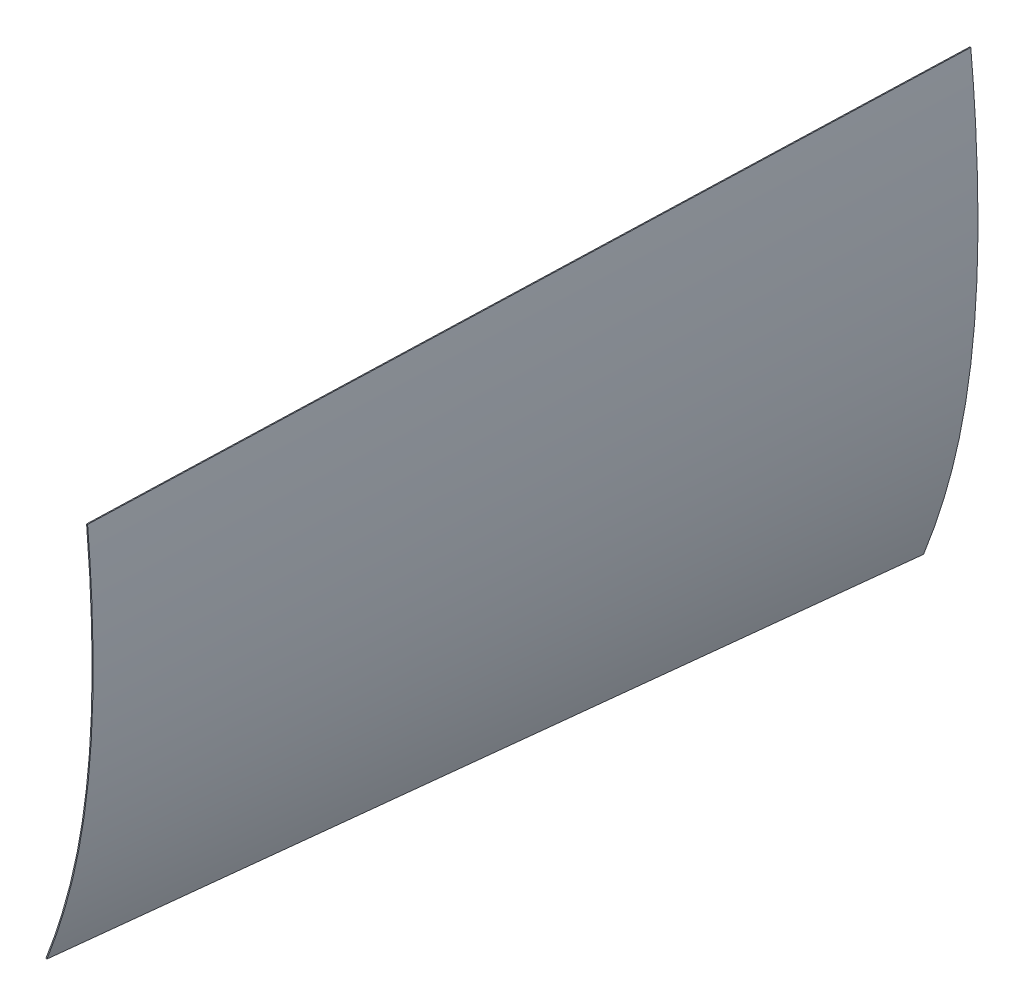
ISO-10303-21;
HEADER;
FILE_DESCRIPTION(('STEP AP214'),'2;1');
FILE_NAME('part.step','',(''),(''),'','','');
FILE_SCHEMA(('AUTOMOTIVE_DESIGN { 1 0 10303 214 1 1 1 1 }'));
ENDSEC;
DATA;
#1=APPLICATION_CONTEXT('core data for automotive mechanical design processes');
#2=APPLICATION_PROTOCOL_DEFINITION('international standard','automotive_design',2000,#1);
#3=PRODUCT_CONTEXT('',#1,'mechanical');
#4=PRODUCT('Part','Part','',(#3));
#5=PRODUCT_RELATED_PRODUCT_CATEGORY('part','',(#4));
#6=PRODUCT_DEFINITION_FORMATION('','',#4);
#7=PRODUCT_DEFINITION_CONTEXT('part definition',#1,'design');
#8=PRODUCT_DEFINITION('design','',#6,#7);
#9=PRODUCT_DEFINITION_SHAPE('','',#8);
#10=(LENGTH_UNIT() NAMED_UNIT(*) SI_UNIT(.MILLI.,.METRE.));
#11=(NAMED_UNIT(*) PLANE_ANGLE_UNIT() SI_UNIT($,.RADIAN.));
#12=(NAMED_UNIT(*) SI_UNIT($,.STERADIAN.) SOLID_ANGLE_UNIT());
#13=UNCERTAINTY_MEASURE_WITH_UNIT(LENGTH_MEASURE(1.E-05),#10,'distance_accuracy_value','');
#14=(GEOMETRIC_REPRESENTATION_CONTEXT(3) GLOBAL_UNCERTAINTY_ASSIGNED_CONTEXT((#13)) GLOBAL_UNIT_ASSIGNED_CONTEXT((#10,
#11,#12)) REPRESENTATION_CONTEXT('',''));
#15=CARTESIAN_POINT('',(0.,0.,0.));
#16=DIRECTION('',(0.,0.,1.));
#17=DIRECTION('',(1.,0.,0.));
#18=AXIS2_PLACEMENT_3D('',#15,#16,#17);
#19=CARTESIAN_POINT('',(466.611140213925,-2996.06608357652,1237.06601958068));
#20=DIRECTION('',(0.0340355254360612,0.,-0.999420623665677));
#21=DIRECTION('',(0.999420623665677,0.,0.0340355254360612));
#22=AXIS2_PLACEMENT_3D('',#19,#20,#21);
#23=PLANE('',#22);
#24=CARTESIAN_POINT('',(464.7329691474,-2683.51000000006,1237.00205798373));
#25=CARTESIAN_POINT('',(470.849624888753,-2750.93837704815,1237.21036226237));
#26=CARTESIAN_POINT('',(474.470158610323,-2827.19923017659,1237.33366046601));
#27=CARTESIAN_POINT('',(468.701212329022,-3041.49687790168,1237.13719752213));
#28=CARTESIAN_POINT('',(445.733833689295,-3153.75817323704,1236.35503755726));
#29=CARTESIAN_POINT('',(403.930987282872,-3259.1200239438,1234.9314309111));
#30=B_SPLINE_CURVE_WITH_KNOTS('',3,(#24,#25,#26,#27,#28,#29),.UNSPECIFIED.,.F.,.F.,(4,2,4),
(-56.739502562534,-40.2608751649169,-9.08244148966291),.UNSPECIFIED.);
#31=CARTESIAN_POINT('',(464.7329691474,-2683.51000000006,1237.00205798373));
#32=VERTEX_POINT('',#31);
#33=CARTESIAN_POINT('',(403.930987282872,-3259.1200239438,1234.9314309111));
#34=VERTEX_POINT('',#33);
#35=EDGE_CURVE('E199',#32,#34,#30,.T.);
#36=ORIENTED_EDGE('',*,*,#35,.T.);
#37=DIRECTION('',(0.928901332384992,-0.368973720543716,0.031633972901222));
#38=VECTOR('',#37,1.);
#39=CARTESIAN_POINT('',(403.930987282872,-3259.1200239438,1234.9314309111));
#40=LINE('',#39,#38);
#41=CARTESIAN_POINT('',(405.346632913427,-3259.68233989391,1234.9796410858));
#42=VERTEX_POINT('',#41);
#43=EDGE_CURVE('E85',#34,#42,#40,.T.);
#44=ORIENTED_EDGE('',*,*,#43,.T.);
#45=CARTESIAN_POINT('',(405.346632913427,-3259.68233989391,1234.9796410858));
#46=CARTESIAN_POINT('',(409.347475200141,-3249.59842973105,1235.11589079507));
#47=CARTESIAN_POINT('',(417.001753177927,-3229.31217603775,1235.37655919298));
#48=CARTESIAN_POINT('',(430.934378250988,-3188.07769701693,1235.85103831002));
#49=CARTESIAN_POINT('',(445.756996623566,-3135.03979825283,1236.35582637693));
#50=CARTESIAN_POINT('',(459.380692330339,-3068.11953927663,1236.81978482523));
#51=CARTESIAN_POINT('',(467.251493917822,-3008.90219119633,1237.08782699015));
#52=CARTESIAN_POINT('',(471.451298297448,-2959.00502041134,1237.23085240448));
#53=CARTESIAN_POINT('',(473.552843033924,-2920.24749419559,1237.30242104899));
#54=CARTESIAN_POINT('',(474.597234533578,-2879.89590932481,1237.33798806913));
#55=CARTESIAN_POINT('',(474.584547279796,-2839.41721128648,1237.33755600146));
#56=CARTESIAN_POINT('',(473.643484070645,-2799.09279437812,1237.30550785272));
#57=CARTESIAN_POINT('',(472.173825744251,-2765.96523019636,1237.25545826183));
#58=CARTESIAN_POINT('',(470.642951911304,-2739.94017213857,1237.20332396117));
#59=CARTESIAN_POINT('',(469.33067590633,-2720.70635667756,1237.15863406555));
#60=CARTESIAN_POINT('',(468.112754832064,-2704.96556617701,1237.11715745128));
#61=CARTESIAN_POINT('',(467.068754703944,-2692.54817563492,1237.0816037594));
#62=CARTESIAN_POINT('',(466.528004546573,-2686.43853357675,1237.06318837422));
#63=CARTESIAN_POINT('',(466.249850610594,-2683.37223897629,1237.05371577066));
#64=B_SPLINE_CURVE_WITH_KNOTS('',3,(#45,#46,#47,#48,#49,#50,#51,#52,#53,#54,#55,#56,#57,#58,#59,
#60,#61,#62,#63),.UNSPECIFIED.,.F.,.F.,(4,1,1,1,1,1,1,1,1,1,1,1,1,1,1,1,4),(-56.7395025625342,
-53.7609362454794,-50.7823699284246,-44.8252372943149,-38.8681046602053,-32.9109720260957,
-29.9324057090409,-26.9538393919861,-23.9752730749313,-20.9967067578765,-18.0181404408217,
-15.0395741237669,-13.5502909652395,-12.0610078067121,-10.5717246481847,-9.82708306892099,
-9.08244148965729),.UNSPECIFIED.);
#65=CARTESIAN_POINT('',(466.249850610594,-2683.37223897629,1237.05371577066));
#66=VERTEX_POINT('',#65);
#67=EDGE_CURVE('E47',#42,#66,#64,.T.);
#68=ORIENTED_EDGE('',*,*,#67,.T.);
#69=DIRECTION('',(-0.995329044090019,-0.0903943725547161,-0.0338961856451289));
#70=VECTOR('',#69,1.);
#71=CARTESIAN_POINT('',(466.249850610594,-2683.37223897629,1237.05371577066));
#72=LINE('',#71,#70);
#73=EDGE_CURVE('E11',#66,#32,#72,.T.);
#74=ORIENTED_EDGE('',*,*,#73,.T.);
#75=EDGE_LOOP('',(#36,#44,#68,#74));
#76=FACE_BOUND('',#75,.T.);
#77=ADVANCED_FACE('F37',(#76),#23,.F.);
#78=CARTESIAN_POINT('',(509.744180299187,-3046.03454501667,0.));
#79=DIRECTION('',(0.,0.,1.));
#80=DIRECTION('',(-1.,0.,0.));
#81=AXIS2_PLACEMENT_3D('',#78,#79,#80);
#82=PLANE('',#81);
#83=CARTESIAN_POINT('',(505.97849639557,-2683.51000038057,0.));
#84=CARTESIAN_POINT('',(513.58770421844,-2763.3905144055,0.));
#85=CARTESIAN_POINT('',(518.261157834598,-2855.4071102022,0.));
#86=CARTESIAN_POINT('',(511.441151076744,-3104.43711127009,0.));
#87=CARTESIAN_POINT('',(485.301285557305,-3232.27565881846,0.));
#88=CARTESIAN_POINT('',(437.778449062825,-3352.30949965526,0.));
#89=B_SPLINE_CURVE_WITH_KNOTS('',3,(#83,#84,#85,#86,#87,#88),.UNSPECIFIED.,.F.,.F.,(4,2,4),
(-64.5398702067748,-44.6981270581919,-9.17980984821859),.UNSPECIFIED.);
#90=CARTESIAN_POINT('',(505.978496547569,-2683.51000036606,0.));
#91=VERTEX_POINT('',#90);
#92=CARTESIAN_POINT('',(437.778449062824,-3352.30949965526,0.));
#93=VERTEX_POINT('',#92);
#94=EDGE_CURVE('E95',#91,#93,#89,.T.);
#95=ORIENTED_EDGE('',*,*,#94,.F.);
#96=DIRECTION('',(-0.995493661252972,-0.0948281097837218,0.));
#97=VECTOR('',#96,1.);
#98=CARTESIAN_POINT('',(505.978496547569,-2683.51000036606,0.));
#99=LINE('',#98,#97);
#100=CARTESIAN_POINT('',(507.495628735318,-2683.36548234123,0.));
#101=VERTEX_POINT('',#100);
#102=EDGE_CURVE('E106',#101,#91,#99,.T.);
#103=ORIENTED_EDGE('',*,*,#102,.F.);
#104=CARTESIAN_POINT('',(439.195436197461,-3352.87050184802,0.));
#105=CARTESIAN_POINT('',(443.832479069598,-3341.15819452116,0.));
#106=CARTESIAN_POINT('',(452.69629078634,-3317.59503413952,0.));
#107=CARTESIAN_POINT('',(468.800365674251,-3269.68402015541,0.));
#108=CARTESIAN_POINT('',(485.870395110676,-3208.01533065638,0.));
#109=CARTESIAN_POINT('',(498.847288629547,-3143.08023434581,0.));
#110=CARTESIAN_POINT('',(506.764061227774,-3088.63978584835,0.));
#111=CARTESIAN_POINT('',(511.467361490751,-3046.43225188581,0.));
#112=CARTESIAN_POINT('',(514.934520054015,-3002.7039939759,0.));
#113=CARTESIAN_POINT('',(516.791881320256,-2964.9170030929,0.));
#114=CARTESIAN_POINT('',(517.658247256269,-2933.74130987213,0.));
#115=CARTESIAN_POINT('',(518.098594210434,-2902.4536117098,0.));
#116=CARTESIAN_POINT('',(517.898894644065,-2863.24377974606,0.));
#117=CARTESIAN_POINT('',(516.80831839843,-2824.30442301188,0.));
#118=CARTESIAN_POINT('',(515.468266720115,-2793.5500406739,0.));
#119=CARTESIAN_POINT('',(514.246025356614,-2770.74222584422,0.));
#120=CARTESIAN_POINT('',(512.82324316337,-2748.25150787216,0.));
#121=CARTESIAN_POINT('',(511.484321184933,-2729.82264190135,0.));
#122=CARTESIAN_POINT('',(510.329573500648,-2715.29751909885,0.));
#123=CARTESIAN_POINT('',(509.423699764513,-2704.51914527117,0.));
#124=CARTESIAN_POINT('',(508.637654296489,-2695.64264307893,0.));
#125=CARTESIAN_POINT('',(507.990503430791,-2688.60146012953,0.));
#126=CARTESIAN_POINT('',(507.662124100124,-2685.11332990081,0.));
#127=CARTESIAN_POINT('',(507.495628735318,-2683.36548234123,0.));
#128=B_SPLINE_CURVE_WITH_KNOTS('',3,(#104,#105,#106,#107,#108,#109,#110,#111,#112,#113,#114,
#115,#116,#117,#118,#119,#120,#121,#122,#123,#124,#125,#126,#127),.UNSPECIFIED.,.F.,.F.,(4,1,1,
1,1,1,1,1,1,1,1,1,1,1,1,1,1,1,1,1,1,4),(-64.5398702067748,-61.079866434365,-57.6198626619553,
-50.6998551171357,-43.7798475723162,-40.3198437999065,-36.8598400274967,-33.3998362550869,
-29.9398324826772,-28.2098305964723,-26.4798287102674,-23.0198249378576,-19.5598211654479,
-17.829819279243,-16.0998173930381,-14.3698155068332,-12.6398136206284,-11.7748126775259,
-10.9098117344235,-10.044810791321,-9.61231031976981,-9.17980984821859),.UNSPECIFIED.);
#129=CARTESIAN_POINT('',(439.195436197461,-3352.87050184802,0.));
#130=VERTEX_POINT('',#129);
#131=EDGE_CURVE('E98',#130,#101,#128,.T.);
#132=ORIENTED_EDGE('',*,*,#131,.F.);
#133=DIRECTION('',(0.929781584407413,-0.368111675034685,0.));
#134=VECTOR('',#133,1.);
#135=CARTESIAN_POINT('',(437.778449062824,-3352.30949965526,0.));
#136=LINE('',#135,#134);
#137=EDGE_CURVE('E81',#93,#130,#136,.T.);
#138=ORIENTED_EDGE('',*,*,#137,.F.);
#139=EDGE_LOOP('',(#95,#103,#132,#138));
#140=FACE_BOUND('',#139,.T.);
#141=ADVANCED_FACE('F93',(#140),#82,.F.);
#142=CARTESIAN_POINT('',(507.495628735318,-2683.36548234123,0.));
#143=CARTESIAN_POINT('',(493.74817096134,-2683.36773220243,412.351269903524));
#144=CARTESIAN_POINT('',(479.999717567642,-2683.36998412596,824.702512339441));
#145=CARTESIAN_POINT('',(466.249850610594,-2683.37223897629,1237.05371577066));
#146=CARTESIAN_POINT('',(508.827591653767,-2697.34826281782,0.));
#147=CARTESIAN_POINT('',(495.007018154946,-2696.77797865411,412.363900041611));
#148=CARTESIAN_POINT('',(481.185449036403,-2696.20769655273,824.727772615616));
#149=CARTESIAN_POINT('',(467.362466354511,-2695.63741737815,1237.09160618492));
#150=CARTESIAN_POINT('',(511.297267721723,-2725.88576392452,0.));
#151=CARTESIAN_POINT('',(497.333199368465,-2724.08798627555,412.38704843802));
#152=CARTESIAN_POINT('',(483.368135395486,-2722.29021068891,824.774069408433));
#153=CARTESIAN_POINT('',(469.401657859157,-2720.49243802907,1237.16105137414));
#154=CARTESIAN_POINT('',(514.347821009394,-2770.60338907823,0.));
#155=CARTESIAN_POINT('',(500.19364227943,-2766.85665684213,412.41520330506));
#156=CARTESIAN_POINT('',(486.038467929744,-2763.10992666836,824.830379142513));
#157=CARTESIAN_POINT('',(471.881880016709,-2759.36319942138,1237.24551597526));
#158=CARTESIAN_POINT('',(516.589150687991,-2816.49991917411,0.));
#159=CARTESIAN_POINT('',(502.27476693136,-2810.69315666581,412.43519050067));
#160=CARTESIAN_POINT('',(487.959387555007,-2804.88639621985,824.870353533734));
#161=CARTESIAN_POINT('',(473.642594615305,-2799.07963870068,1237.3054775621));
#162=CARTESIAN_POINT('',(517.681485866151,-2855.46939040776,0.));
#163=CARTESIAN_POINT('',(503.264701743123,-2847.88010964437,412.444103148086));
#164=CARTESIAN_POINT('',(488.846922000373,-2840.29083094331,824.888178828565));
#165=CARTESIAN_POINT('',(474.427728694273,-2832.70155516905,1237.33221550434));
#166=CARTESIAN_POINT('',(518.018298637372,-2886.76577098574,0.));
#167=CARTESIAN_POINT('',(503.543729146635,-2877.72950532307,412.445958667658));
#168=CARTESIAN_POINT('',(489.068164036177,-2868.69324172274,824.891889867709));
#169=CARTESIAN_POINT('',(474.591185362369,-2859.6569810492,1237.33778206306));
#170=CARTESIAN_POINT('',(517.988957992467,-2910.27358916557,0.));
#171=CARTESIAN_POINT('',(503.482197724599,-2900.14121363483,412.444529334767));
#172=CARTESIAN_POINT('',(488.974441837009,-2890.00884016642,824.889031201927));
#173=CARTESIAN_POINT('',(474.46527238607,-2879.87646962482,1237.33349406439));
#174=CARTESIAN_POINT('',(517.657623604745,-2933.74976048812,0.));
#175=CARTESIAN_POINT('',(503.131108588284,-2922.52412136783,412.440095355916));
#176=CARTESIAN_POINT('',(488.603597952102,-2911.29848430988,824.880163244226));
#177=CARTESIAN_POINT('',(474.07467375257,-2900.07285017872,1237.32019212783));
#178=CARTESIAN_POINT('',(516.793178602334,-2964.89422368208,0.));
#179=CARTESIAN_POINT('',(502.26392921947,-2952.16710469531,412.430189271012));
#180=CARTESIAN_POINT('',(487.733684216884,-2939.43998777088,824.860351074418));
#181=CARTESIAN_POINT('',(473.202025650948,-2926.71287377324,1237.29047387312));
#182=CARTESIAN_POINT('',(514.933315609084,-3002.72047246472,0.));
#183=CARTESIAN_POINT('',(500.441176158102,-2988.14326563621,412.410340355645));
#184=CARTESIAN_POINT('',(485.948041087398,-2973.56606087004,824.820653243683));
#185=CARTESIAN_POINT('',(471.453492453345,-2958.98885903066,1237.23092712702));
#186=CARTESIAN_POINT('',(511.468177495917,-3046.42344218057,0.));
#187=CARTESIAN_POINT('',(497.079274007741,-3029.766573023,412.374520694024));
#188=CARTESIAN_POINT('',(482.689374899843,-3013.10970592777,824.749013920441));
#189=CARTESIAN_POINT('',(468.298062228597,-2996.45284175933,1237.12346814216));
#190=CARTESIAN_POINT('',(506.76352305225,-3088.64448572412,0.));
#191=CARTESIAN_POINT('',(492.544128997268,-3069.96328718899,412.326887310331));
#192=CARTESIAN_POINT('',(478.323739322565,-3051.2820907162,824.653747153055));
#193=CARTESIAN_POINT('',(464.101936084512,-3032.60089717021,1236.98056799108));
#194=CARTESIAN_POINT('',(500.82682652727,-3129.46761923665,0.));
#195=CARTESIAN_POINT('',(486.839247569251,-3108.84135479105,412.267389925722));
#196=CARTESIAN_POINT('',(472.85067299151,-3088.21509240778,824.534752383837));
#197=CARTESIAN_POINT('',(458.86068485042,-3067.58883295131,1236.80207583725));
#198=CARTESIAN_POINT('',(493.656315855566,-3169.05560382332,0.));
#199=CARTESIAN_POINT('',(479.961971956524,-3146.56121912861,412.195978261351));
#200=CARTESIAN_POINT('',(466.26663243776,-3124.06683649625,824.391929055095));
#201=CARTESIAN_POINT('',(452.569879355647,-3101.57245679068,1236.58784084414));
#202=CARTESIAN_POINT('',(485.256556497086,-3207.52466246282,0.));
#203=CARTESIAN_POINT('',(471.917243833806,-3183.22873471464,412.112716955276));
#204=CARTESIAN_POINT('',(458.576935550804,-3158.93280902881,824.225406442946));
#205=CARTESIAN_POINT('',(445.235213704454,-3134.63688626977,1236.33805692591));
#206=CARTESIAN_POINT('',(475.628298133442,-3245.0169207818,0.));
#207=CARTESIAN_POINT('',(462.707461023592,-3218.96702449407,412.017670645556));
#208=CARTESIAN_POINT('',(449.78562829402,-3192.91713026868,824.035313823506));
#209=CARTESIAN_POINT('',(436.862382001098,-3166.86723897008,1236.05291799675));
#210=CARTESIAN_POINT('',(464.774394207468,-3281.66157133293,0.));
#211=CARTESIAN_POINT('',(452.334662029033,-3253.90224299883,411.910843970788));
#212=CARTESIAN_POINT('',(439.893934230876,-3226.14291672707,823.821660473969));
#213=CARTESIAN_POINT('',(427.45179286937,-3198.38359338211,1235.73243797245));
#214=CARTESIAN_POINT('',(452.696262773257,-3317.59514553224,0.));
#215=CARTESIAN_POINT('',(440.799928427455,-3288.16543733646,411.792241569568));
#216=CARTESIAN_POINT('',(428.90259846193,-3258.73573120303,823.58445567153));
#217=CARTESIAN_POINT('',(417.003854933057,-3229.30602799639,1235.37663076879));
#218=CARTESIAN_POINT('',(443.832479069598,-3341.15819452116,0.));
#219=CARTESIAN_POINT('',(432.338612714043,-3310.63827057396,411.705328244996));
#220=CARTESIAN_POINT('',(420.843750738767,-3280.11834868911,823.410629022385));
#221=CARTESIAN_POINT('',(409.347475200141,-3249.59842973105,1235.11589079507));
#222=CARTESIAN_POINT('',(439.195436197461,-3352.87050184802,0.));
#223=CARTESIAN_POINT('',(427.913636703714,-3321.80777884616,411.659911675238));
#224=CARTESIAN_POINT('',(416.630841590245,-3290.74505790663,823.31979588287));
#225=CARTESIAN_POINT('',(405.346632913427,-3259.68233989391,1234.9796410858));
#226=B_SPLINE_SURFACE_WITH_KNOTS('',3,3,((#142,#143,#144,#145),(#146,#147,#148,#149),(#150,#151,
#152,#153),(#154,#155,#156,#157),(#158,#159,#160,#161),(#162,#163,#164,#165),(#166,#167,#168,
#169),(#170,#171,#172,#173),(#174,#175,#176,#177),(#178,#179,#180,#181),(#182,#183,#184,#185),
(#186,#187,#188,#189),(#190,#191,#192,#193),(#194,#195,#196,#197),(#198,#199,#200,#201),(#202,
#203,#204,#205),(#206,#207,#208,#209),(#210,#211,#212,#213),(#214,#215,#216,#217),(#218,#219,
#220,#221),(#222,#223,#224,#225)),.UNSPECIFIED.,.F.,.F.,.F.,(4,1,1,1,1,1,1,1,1,1,1,1,1,1,1,1,1,
1,4),(4,4),(0.500925383849193,0.532117547358619,0.563309710868044,0.594501874377469,
0.625694037886895,0.641290119641608,0.65688620139632,0.672482283151033,0.688078364905746,
0.719270528415171,0.750462691924597,0.781654855434022,0.812847018943448,0.844039182452873,
0.875231345962298,0.906423509471724,0.937615672981149,0.968807836490575,1.),(0.,1.),.UNSPECIFIED.);
#227=CARTESIAN_POINT('',(507.495628735318,-2683.36548234123,0.));
#228=CARTESIAN_POINT('',(493.74817096134,-2683.36773220243,412.351269903524));
#229=CARTESIAN_POINT('',(479.999717567642,-2683.36998412596,824.702512339441));
#230=CARTESIAN_POINT('',(466.249850610594,-2683.37223897629,1237.05371577066));
#231=B_SPLINE_CURVE_WITH_KNOTS('',3,(#227,#228,#229,#230),.UNSPECIFIED.,.F.,.F.,(4,4),(0.,1.),.UNSPECIFIED.);
#232=EDGE_CURVE('E227',#101,#66,#231,.T.);
#233=CARTESIAN_POINT('',(439.195436197461,-3352.87050184802,0.));
#234=CARTESIAN_POINT('',(427.913636703714,-3321.80777884616,411.659911675238));
#235=CARTESIAN_POINT('',(416.630841590245,-3290.74505790663,823.31979588287));
#236=CARTESIAN_POINT('',(405.346632913427,-3259.68233989391,1234.9796410858));
#237=B_SPLINE_CURVE_WITH_KNOTS('',3,(#233,#234,#235,#236),.UNSPECIFIED.,.F.,.F.,(4,4),(0.,1.),.UNSPECIFIED.);
#238=EDGE_CURVE('E62',#130,#42,#237,.T.);
#239=ORIENTED_EDGE('',*,*,#131,.T.);
#240=ORIENTED_EDGE('',*,*,#232,.T.);
#241=ORIENTED_EDGE('',*,*,#67,.F.);
#242=ORIENTED_EDGE('',*,*,#238,.F.);
#243=EDGE_LOOP('',(#239,#240,#241,#242));
#244=FACE_BOUND('',#243,.T.);
#245=ADVANCED_FACE('F172',(#244),#226,.F.);
#246=CARTESIAN_POINT('',(505.978496547569,-2683.51000036606,0.));
#247=CARTESIAN_POINT('',(492.231122348444,-2683.50999789357,412.334050641216));
#248=CARTESIAN_POINT('',(478.482752529597,-2683.50999748342,824.668073814826));
#249=CARTESIAN_POINT('',(464.7329691474,-2683.51000000006,1237.00205798373));
#250=CARTESIAN_POINT('',(506.104924229881,-2683.49795719733,0.));
#251=CARTESIAN_POINT('',(492.357543066185,-2683.49814241931,412.335485579742));
#252=CARTESIAN_POINT('',(478.609166282767,-2683.49832970363,824.670943691877));
#253=CARTESIAN_POINT('',(464.859375936,-2683.49851991474,1237.00636279931));
#254=CARTESIAN_POINT('',(506.357779594505,-2683.47387085985,0.));
#255=CARTESIAN_POINT('',(492.610384501667,-2683.47443147078,412.338355456792));
#256=CARTESIAN_POINT('',(478.861993789108,-2683.47499414405,824.676683445978));
#257=CARTESIAN_POINT('',(465.112189513198,-2683.47555974411,1237.01497243046));
#258=CARTESIAN_POINT('',(506.737062641444,-2683.43774135365,0.));
#259=CARTESIAN_POINT('',(492.989646654893,-2683.438865048,412.34266027237));
#260=CARTESIAN_POINT('',(479.24123504862,-2683.43999080469,824.685293077134));
#261=CARTESIAN_POINT('',(465.491409878997,-2683.44111948817,1237.0278868772));
#262=CARTESIAN_POINT('',(507.11634568838,-2683.40161184744,0.));
#263=CARTESIAN_POINT('',(493.368908808116,-2683.40329862521,412.346965087947));
#264=CARTESIAN_POINT('',(479.62047630813,-2683.40498746532,824.693902708287));
#265=CARTESIAN_POINT('',(465.870630244795,-2683.40667923223,1237.04080132393));
#266=CARTESIAN_POINT('',(507.369201053005,-2683.37752550997,0.));
#267=CARTESIAN_POINT('',(493.621750243599,-2683.37958767669,412.349834964998));
#268=CARTESIAN_POINT('',(479.873303814471,-2683.38165190575,824.69964246239));
#269=CARTESIAN_POINT('',(466.123443821994,-2683.3837190616,1237.04941095508));
#270=CARTESIAN_POINT('',(507.495628735318,-2683.36548234123,0.));
#271=CARTESIAN_POINT('',(493.74817096134,-2683.36773220243,412.351269903524));
#272=CARTESIAN_POINT('',(479.999717567642,-2683.36998412596,824.702512339441));
#273=CARTESIAN_POINT('',(466.249850610594,-2683.37223897629,1237.05371577066));
#274=B_SPLINE_SURFACE_WITH_KNOTS('',3,3,((#246,#247,#248,#249),(#250,#251,#252,#253),(#254,#255,
#256,#257),(#258,#259,#260,#261),(#262,#263,#264,#265),(#266,#267,#268,#269),(#270,#271,#272,
#273)),.UNSPECIFIED.,.F.,.F.,.F.,(4,1,1,1,4),(4,4),(0.499715707047186,0.500018126247688,
0.50032054544819,0.500622964648691,0.500925383849193),(0.,1.),.UNSPECIFIED.);
#275=CARTESIAN_POINT('',(505.978496547569,-2683.51000036606,0.));
#276=CARTESIAN_POINT('',(492.231122348444,-2683.50999789357,412.334050641216));
#277=CARTESIAN_POINT('',(478.482752529597,-2683.50999748342,824.668073814826));
#278=CARTESIAN_POINT('',(464.7329691474,-2683.51000000006,1237.00205798373));
#279=B_SPLINE_CURVE_WITH_KNOTS('',3,(#275,#276,#277,#278),.UNSPECIFIED.,.F.,.F.,(4,4),(0.,1.),.UNSPECIFIED.);
#280=EDGE_CURVE('E88',#91,#32,#279,.T.);
#281=ORIENTED_EDGE('',*,*,#102,.T.);
#282=ORIENTED_EDGE('',*,*,#280,.T.);
#283=ORIENTED_EDGE('',*,*,#73,.F.);
#284=ORIENTED_EDGE('',*,*,#232,.F.);
#285=EDGE_LOOP('',(#281,#282,#283,#284));
#286=FACE_BOUND('',#285,.T.);
#287=ADVANCED_FACE('F129',(#286),#274,.F.);
#288=CARTESIAN_POINT('',(437.778449062825,-3352.30949965526,0.));
#289=CARTESIAN_POINT('',(426.497096737104,-3321.24633873428,411.643841617005));
#290=CARTESIAN_POINT('',(415.214748791663,-3290.18317987564,823.287655766402));
#291=CARTESIAN_POINT('',(403.930987282872,-3259.1200239438,1234.9314309111));
#292=CARTESIAN_POINT('',(442.407868654256,-3340.61644731675,0.));
#293=CARTESIAN_POINT('',(430.914558904913,-3310.09579597903,411.689175376115));
#294=CARTESIAN_POINT('',(419.420253535849,-3279.57514670366,823.378323284623));
#295=CARTESIAN_POINT('',(407.924534603435,-3249.05450035508,1235.06743218843));
#296=CARTESIAN_POINT('',(451.260852471162,-3317.08228911258,0.));
#297=CARTESIAN_POINT('',(439.364490230849,-3287.65340930451,411.775946197729));
#298=CARTESIAN_POINT('',(427.467132370814,-3258.22453155878,823.55186492785));
#299=CARTESIAN_POINT('',(415.56836094743,-3228.79565673985,1235.32774465327));
#300=CARTESIAN_POINT('',(463.320814433286,-3281.20250610852,0.));
#301=CARTESIAN_POINT('',(450.881850512445,-3253.44191141048,411.89436945677));
#302=CARTESIAN_POINT('',(438.441890971883,-3225.68131877478,823.788711445933));
#303=CARTESIAN_POINT('',(426.000517867972,-3197.92072906588,1235.68301443039));
#304=CARTESIAN_POINT('',(474.158883029026,-3244.61124241272,0.));
#305=CARTESIAN_POINT('',(461.238828449951,-3218.55944799233,412.001016858871));
#306=CARTESIAN_POINT('',(448.317778251154,-3192.50765563428,824.002006250136));
#307=CARTESIAN_POINT('',(435.395314489008,-3166.45586620303,1236.0029566367));
#308=CARTESIAN_POINT('',(483.773391776168,-3207.17295567328,0.));
#309=CARTESIAN_POINT('',(470.434653963191,-3182.8752551573,412.095900013741));
#310=CARTESIAN_POINT('',(457.094920530493,-3158.57755670365,824.191772559876));
#311=CARTESIAN_POINT('',(443.753773534445,-3134.2798611768,1236.28760610131));
#312=CARTESIAN_POINT('',(492.161480581856,-3168.7569829697,0.));
#313=CARTESIAN_POINT('',(478.467761231566,-3146.26182196687,412.179030531088));
#314=CARTESIAN_POINT('',(464.773046261554,-3123.76666302639,824.35803359457));
#315=CARTESIAN_POINT('',(451.076917728193,-3101.27150701269,1236.53699765335));
#316=CARTESIAN_POINT('',(499.322256606243,-3129.22348923256,0.));
#317=CARTESIAN_POINT('',(485.335375828344,-3108.59557191817,412.250334197692));
#318=CARTESIAN_POINT('',(471.347499430724,-3087.96765666612,824.500640927778));
#319=CARTESIAN_POINT('',(457.358209469754,-3067.33974434086,1236.75090865316));
#320=CARTESIAN_POINT('',(505.251639948149,-3088.44988983731,0.));
#321=CARTESIAN_POINT('',(491.03259861924,-3069.76442880486,412.309736800332));
#322=CARTESIAN_POINT('',(476.81256167061,-3051.07896983476,824.619446133057));
#323=CARTESIAN_POINT('',(462.591111158631,-3032.39351379144,1236.92911646108));
#324=CARTESIAN_POINT('',(509.950602964876,-3046.28126623269,0.));
#325=CARTESIAN_POINT('',(495.563820288616,-3029.61258297922,412.357365788975));
#326=CARTESIAN_POINT('',(481.176041992634,-3012.9439017881,824.714704110344));
#327=CARTESIAN_POINT('',(466.786850133302,-2996.27522352377,1237.07200342701));
#328=CARTESIAN_POINT('',(513.412320031551,-3002.6226056554,0.));
#329=CARTESIAN_POINT('',(498.919511394105,-2988.04855080943,412.393051601614));
#330=CARTESIAN_POINT('',(484.425707136936,-2973.47449802579,824.786075735622));
#331=CARTESIAN_POINT('',(469.930489316419,-2958.90044816895,1237.17906086493));
#332=CARTESIAN_POINT('',(515.270073466372,-2964.83130265488,0.));
#333=CARTESIAN_POINT('',(500.741650205037,-2952.099943749,412.412927492894));
#334=CARTESIAN_POINT('',(486.21223132398,-2939.36858690547,824.825827518182));
#335=CARTESIAN_POINT('',(471.681398879574,-2926.63723298873,1237.23868853877));
#336=CARTESIAN_POINT('',(516.134071222574,-2933.72135512702,0.));
#337=CARTESIAN_POINT('',(501.608172244269,-2922.49172976234,412.422821346327));
#338=CARTESIAN_POINT('',(487.081277646243,-2911.26210646,824.845615225047));
#339=CARTESIAN_POINT('',(472.552969484867,-2900.03248608445,1237.26837009907));
#340=CARTESIAN_POINT('',(516.4647296569,-2910.26031191867,0.));
#341=CARTESIAN_POINT('',(501.958393222938,-2900.12784025339,412.427241106358));
#342=CARTESIAN_POINT('',(487.451061169254,-2889.99537065044,824.854454745109));
#343=CARTESIAN_POINT('',(472.942315552221,-2879.86290397429,1237.28162937916));
#344=CARTESIAN_POINT('',(516.494601774156,-2886.77390422102,0.));
#345=CARTESIAN_POINT('',(502.020061573354,-2877.73538892362,412.428663036095));
#346=CARTESIAN_POINT('',(487.544525752831,-2868.69687568856,824.857298604583));
#347=CARTESIAN_POINT('',(473.067576368958,-2859.6583653803,1237.28589516837));
#348=CARTESIAN_POINT('',(516.157362928302,-2855.49921203863,0.));
#349=CARTESIAN_POINT('',(501.740798255032,-2847.9064350272,412.426809155771));
#350=CARTESIAN_POINT('',(487.32323796204,-2840.31366007812,824.853590843935));
#351=CARTESIAN_POINT('',(472.904264105699,-2832.72088805582,1237.2803335274));
#352=CARTESIAN_POINT('',(515.06685680271,-2816.56615964625,0.));
#353=CARTESIAN_POINT('',(500.752910080157,-2810.75863261801,412.417924681196));
#354=CARTESIAN_POINT('',(486.437967737882,-2804.95110765211,824.835821894786));
#355=CARTESIAN_POINT('',(472.121611832259,-2799.14358561301,1237.25368010367));
#356=CARTESIAN_POINT('',(512.82508981026,-2770.67786420968,0.));
#357=CARTESIAN_POINT('',(498.67074525894,-2766.9263312128,412.397911990911));
#358=CARTESIAN_POINT('',(484.515405087898,-2763.17480027826,824.795796514216));
#359=CARTESIAN_POINT('',(470.358651353506,-2759.42327227052,1237.19364203282));
#360=CARTESIAN_POINT('',(509.780459436334,-2726.03399237667,0.));
#361=CARTESIAN_POINT('',(495.81706637811,-2724.23940008257,412.369853003753));
#362=CARTESIAN_POINT('',(481.852677700165,-2722.44480985081,824.7396785399));
#363=CARTESIAN_POINT('',(467.88687545887,-2720.65022254584,1237.10946507135));
#364=CARTESIAN_POINT('',(507.305390286648,-2697.43956684046,0.));
#365=CARTESIAN_POINT('',(493.484253415622,-2696.8590094799,412.346601203288));
#366=CARTESIAN_POINT('',(479.662120924875,-2696.27845418169,824.69317493897));
#367=CARTESIAN_POINT('',(465.838574870778,-2695.69790181026,1237.03970966995));
#368=CARTESIAN_POINT('',(505.978496547569,-2683.51000036606,0.));
#369=CARTESIAN_POINT('',(492.231122348444,-2683.50999789357,412.334050641216));
#370=CARTESIAN_POINT('',(478.482752529597,-2683.50999748342,824.668073814826));
#371=CARTESIAN_POINT('',(464.7329691474,-2683.51000000006,1237.00205798373));
#372=B_SPLINE_SURFACE_WITH_KNOTS('',3,3,((#288,#289,#290,#291),(#292,#293,#294,#295),(#296,#297,
#298,#299),(#300,#301,#302,#303),(#304,#305,#306,#307),(#308,#309,#310,#311),(#312,#313,#314,
#315),(#316,#317,#318,#319),(#320,#321,#322,#323),(#324,#325,#326,#327),(#328,#329,#330,#331),
(#332,#333,#334,#335),(#336,#337,#338,#339),(#340,#341,#342,#343),(#344,#345,#346,#347),(#348,
#349,#350,#351),(#352,#353,#354,#355),(#356,#357,#358,#359),(#360,#361,#362,#363),(#364,#365,
#366,#367),(#368,#369,#370,#371)),.UNSPECIFIED.,.F.,.F.,.F.,(4,1,1,1,1,1,1,1,1,1,1,1,1,1,1,1,1,
1,4),(4,4),(0.00120967685808938,0.0323663037449079,0.0635229306317265,0.094679557518545,
0.125836184405364,0.156992811292182,0.188149438179001,0.219306065065819,0.250462691952638,
0.281619318839456,0.312775945726275,0.328354259169684,0.343932572613093,0.359510886056503,
0.375089199499912,0.40624582638673,0.437402453273549,0.468559080160368,0.499715707047186),(0.,
1.),.UNSPECIFIED.);
#373=CARTESIAN_POINT('',(437.778449062825,-3352.30949965526,0.));
#374=CARTESIAN_POINT('',(426.497096737104,-3321.24633873428,411.643841617005));
#375=CARTESIAN_POINT('',(415.214748791663,-3290.18317987564,823.287655766402));
#376=CARTESIAN_POINT('',(403.930987282872,-3259.1200239438,1234.9314309111));
#377=B_SPLINE_CURVE_WITH_KNOTS('',3,(#373,#374,#375,#376),.UNSPECIFIED.,.F.,.F.,(4,4),(0.,1.),.UNSPECIFIED.);
#378=EDGE_CURVE('E55',#93,#34,#377,.T.);
#379=ORIENTED_EDGE('',*,*,#94,.T.);
#380=ORIENTED_EDGE('',*,*,#378,.T.);
#381=ORIENTED_EDGE('',*,*,#35,.F.);
#382=ORIENTED_EDGE('',*,*,#280,.F.);
#383=EDGE_LOOP('',(#379,#380,#381,#382));
#384=FACE_BOUND('',#383,.T.);
#385=ADVANCED_FACE('F104',(#384),#372,.F.);
#386=CARTESIAN_POINT('',(439.195436197461,-3352.87050184802,0.));
#387=CARTESIAN_POINT('',(427.913636703714,-3321.80777884616,411.659911675238));
#388=CARTESIAN_POINT('',(416.630841590245,-3290.74505790663,823.31979588287));
#389=CARTESIAN_POINT('',(405.346632913427,-3259.68233989391,1234.9796410858));
#390=CARTESIAN_POINT('',(439.077353936241,-3352.82375166529,0.));
#391=CARTESIAN_POINT('',(427.795591706496,-3321.76099217017,411.658572503719));
#392=CARTESIAN_POINT('',(416.51283385703,-3290.69823473738,823.317117539831));
#393=CARTESIAN_POINT('',(405.228662444214,-3259.6354802314,1234.97562357124));
#394=CARTESIAN_POINT('',(438.841189413803,-3352.73025129983,0.));
#395=CARTESIAN_POINT('',(427.559501712062,-3321.66741881819,411.65589416068));
#396=CARTESIAN_POINT('',(416.2768183906,-3290.60458839889,823.311760853754));
#397=CARTESIAN_POINT('',(404.992721505788,-3259.54176090638,1234.96758854213));
#398=CARTESIAN_POINT('',(438.486942630142,-3352.59000075164,0.));
#399=CARTESIAN_POINT('',(427.205366720408,-3321.52705879022,411.651876646121));
#400=CARTESIAN_POINT('',(415.922795190953,-3290.46411889114,823.303725824635));
#401=CARTESIAN_POINT('',(404.638810098149,-3259.40118191885,1234.95553599845));
#402=CARTESIAN_POINT('',(438.132695846484,-3352.44975020345,0.));
#403=CARTESIAN_POINT('',(426.851231728757,-3321.38669876225,411.647859131563));
#404=CARTESIAN_POINT('',(415.568771991308,-3290.32364938339,823.29569079552));
#405=CARTESIAN_POINT('',(404.284898690511,-3259.26060293133,1234.94348345477));
#406=CARTESIAN_POINT('',(437.896531324044,-3352.35624983799,0.));
#407=CARTESIAN_POINT('',(426.615141734322,-3321.29312541027,411.645180788524));
#408=CARTESIAN_POINT('',(415.332756524878,-3290.23000304489,823.290334109441));
#409=CARTESIAN_POINT('',(404.048957752085,-3259.16688360631,1234.93544842566));
#410=CARTESIAN_POINT('',(437.778449062825,-3352.30949965526,0.));
#411=CARTESIAN_POINT('',(426.497096737104,-3321.24633873428,411.643841617005));
#412=CARTESIAN_POINT('',(415.214748791663,-3290.18317987564,823.287655766402));
#413=CARTESIAN_POINT('',(403.930987282872,-3259.1200239438,1234.9314309111));
#414=B_SPLINE_SURFACE_WITH_KNOTS('',3,3,((#386,#387,#388,#389),(#390,#391,#392,#393),(#394,#395,
#396,#397),(#398,#399,#400,#401),(#402,#403,#404,#405),(#406,#407,#408,#409),(#410,#411,#412,
#413)),.UNSPECIFIED.,.F.,.F.,.F.,(4,1,1,1,4),(4,4),(0.,0.000302419214522346,
0.000604838429044692,0.000907257643567038,0.00120967685808938),(0.,1.),.UNSPECIFIED.);
#415=ORIENTED_EDGE('',*,*,#137,.T.);
#416=ORIENTED_EDGE('',*,*,#238,.T.);
#417=ORIENTED_EDGE('',*,*,#43,.F.);
#418=ORIENTED_EDGE('',*,*,#378,.F.);
#419=EDGE_LOOP('',(#415,#416,#417,#418));
#420=FACE_BOUND('',#419,.T.);
#421=ADVANCED_FACE('F80',(#420),#414,.F.);
#422=CLOSED_SHELL('',(#77,#141,#245,#287,#385,#421));
#423=MANIFOLD_SOLID_BREP('B2',#422);
#424=ADVANCED_BREP_SHAPE_REPRESENTATION('',(#18,#423),#14);
#425=SHAPE_DEFINITION_REPRESENTATION(#9,#424);
ENDSEC;
END-ISO-10303-21;
